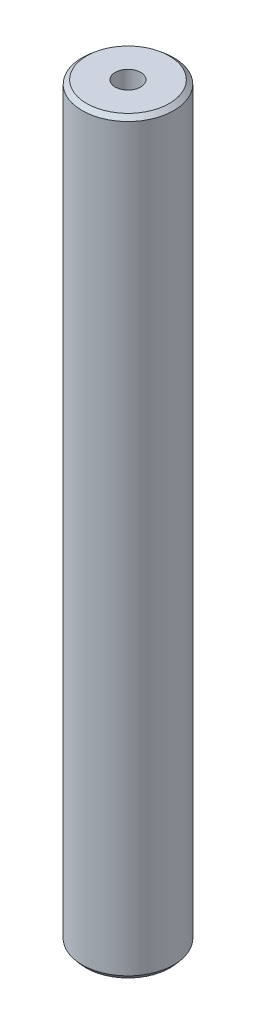
ISO-10303-21;
HEADER;
FILE_DESCRIPTION(('STEP AP214'),'2;1');
FILE_NAME('part.step','',(''),(''),'','','');
FILE_SCHEMA(('AUTOMOTIVE_DESIGN { 1 0 10303 214 1 1 1 1 }'));
ENDSEC;
DATA;
#1=APPLICATION_CONTEXT('core data for automotive mechanical design processes');
#2=APPLICATION_PROTOCOL_DEFINITION('international standard','automotive_design',2000,#1);
#3=PRODUCT_CONTEXT('',#1,'mechanical');
#4=PRODUCT('Part','Part','',(#3));
#5=PRODUCT_RELATED_PRODUCT_CATEGORY('part','',(#4));
#6=PRODUCT_DEFINITION_FORMATION('','',#4);
#7=PRODUCT_DEFINITION_CONTEXT('part definition',#1,'design');
#8=PRODUCT_DEFINITION('design','',#6,#7);
#9=PRODUCT_DEFINITION_SHAPE('','',#8);
#10=(LENGTH_UNIT() NAMED_UNIT(*) SI_UNIT(.MILLI.,.METRE.));
#11=(NAMED_UNIT(*) PLANE_ANGLE_UNIT() SI_UNIT($,.RADIAN.));
#12=(NAMED_UNIT(*) SI_UNIT($,.STERADIAN.) SOLID_ANGLE_UNIT());
#13=UNCERTAINTY_MEASURE_WITH_UNIT(LENGTH_MEASURE(1.E-05),#10,'distance_accuracy_value','');
#14=(GEOMETRIC_REPRESENTATION_CONTEXT(3) GLOBAL_UNCERTAINTY_ASSIGNED_CONTEXT((#13)) GLOBAL_UNIT_ASSIGNED_CONTEXT((#10,
#11,#12)) REPRESENTATION_CONTEXT('',''));
#15=CARTESIAN_POINT('',(0.,0.,0.));
#16=DIRECTION('',(0.,0.,1.));
#17=DIRECTION('',(1.,0.,0.));
#18=AXIS2_PLACEMENT_3D('',#15,#16,#17);
#19=CARTESIAN_POINT('',(0.,122.414115146037,0.));
#20=DIRECTION('',(0.,-1.,0.));
#21=DIRECTION('',(0.,0.,-1.));
#22=AXIS2_PLACEMENT_3D('',#19,#20,#21);
#23=CYLINDRICAL_SURFACE('',#22,7.5);
#24=CARTESIAN_POINT('',(0.,121.785864783848,0.));
#25=DIRECTION('',(0.,1.,0.));
#26=DIRECTION('',(0.,0.,1.));
#27=AXIS2_PLACEMENT_3D('',#24,#25,#26);
#28=CIRCLE('',#27,7.5);
#29=CARTESIAN_POINT('',(0.,121.785864783848,7.5));
#30=VERTEX_POINT('',#29);
#31=EDGE_CURVE('E50',#30,#30,#28,.F.);
#32=ORIENTED_EDGE('',*,*,#31,.T.);
#33=EDGE_LOOP('',(#32));
#34=FACE_BOUND('',#33,.T.);
#35=CARTESIAN_POINT('',(0.,0.748238375106486,0.));
#36=DIRECTION('',(0.,1.,0.));
#37=DIRECTION('',(0.,0.,1.));
#38=AXIS2_PLACEMENT_3D('',#35,#36,#37);
#39=CIRCLE('',#38,7.5);
#40=CARTESIAN_POINT('',(0.,0.748238375106486,7.5));
#41=VERTEX_POINT('',#40);
#42=EDGE_CURVE('E51',#41,#41,#39,.T.);
#43=ORIENTED_EDGE('',*,*,#42,.T.);
#44=EDGE_LOOP('',(#43));
#45=FACE_BOUND('',#44,.T.);
#46=ADVANCED_FACE('F39',(#34,#45),#23,.T.);
#47=CARTESIAN_POINT('',(0.,122.414115146037,0.));
#48=DIRECTION('',(0.,1.,0.));
#49=DIRECTION('',(0.,0.,1.));
#50=AXIS2_PLACEMENT_3D('',#47,#48,#49);
#51=PLANE('',#50);
#52=CARTESIAN_POINT('',(0.,122.414115146037,0.));
#53=DIRECTION('',(0.,1.,0.));
#54=DIRECTION('',(0.,0.,1.));
#55=AXIS2_PLACEMENT_3D('',#52,#53,#54);
#56=CIRCLE('',#55,6.75176162489352);
#57=CARTESIAN_POINT('',(0.,122.414115146037,6.75176162489352));
#58=VERTEX_POINT('',#57);
#59=EDGE_CURVE('E54',#58,#58,#56,.T.);
#60=ORIENTED_EDGE('',*,*,#59,.T.);
#61=EDGE_LOOP('',(#60));
#62=FACE_BOUND('',#61,.T.);
#63=CARTESIAN_POINT('',(0.,122.414115146037,0.));
#64=DIRECTION('',(0.,1.,0.));
#65=DIRECTION('',(0.,0.,1.));
#66=AXIS2_PLACEMENT_3D('',#63,#64,#65);
#67=CIRCLE('',#66,2.08619085192331);
#68=CARTESIAN_POINT('',(0.,122.414115146037,2.08619085192331));
#69=VERTEX_POINT('',#68);
#70=EDGE_CURVE('E58',#69,#69,#67,.T.);
#71=ORIENTED_EDGE('',*,*,#70,.F.);
#72=EDGE_LOOP('',(#71));
#73=FACE_BOUND('',#72,.T.);
#74=ADVANCED_FACE('F69',(#62,#73),#51,.T.);
#75=CARTESIAN_POINT('',(0.,0.,0.));
#76=DIRECTION('',(0.,1.,0.));
#77=DIRECTION('',(0.,0.,1.));
#78=AXIS2_PLACEMENT_3D('',#75,#76,#77);
#79=PLANE('',#78);
#80=CARTESIAN_POINT('',(0.,0.,0.));
#81=DIRECTION('',(0.,1.,0.));
#82=DIRECTION('',(0.,0.,1.));
#83=AXIS2_PLACEMENT_3D('',#80,#81,#82);
#84=CIRCLE('',#83,6.87174963781073);
#85=CARTESIAN_POINT('',(0.,0.,6.87174963781073));
#86=VERTEX_POINT('',#85);
#87=EDGE_CURVE('E10',#86,#86,#84,.F.);
#88=ORIENTED_EDGE('',*,*,#87,.T.);
#89=EDGE_LOOP('',(#88));
#90=FACE_BOUND('',#89,.T.);
#91=CARTESIAN_POINT('',(0.,0.,0.));
#92=DIRECTION('',(0.,1.,0.));
#93=DIRECTION('',(0.,0.,1.));
#94=AXIS2_PLACEMENT_3D('',#91,#92,#93);
#95=CIRCLE('',#94,2.08619085192331);
#96=CARTESIAN_POINT('',(0.,0.,2.08619085192331));
#97=VERTEX_POINT('',#96);
#98=EDGE_CURVE('E63',#97,#97,#95,.T.);
#99=ORIENTED_EDGE('',*,*,#98,.T.);
#100=EDGE_LOOP('',(#99));
#101=FACE_BOUND('',#100,.T.);
#102=ADVANCED_FACE('F75',(#90,#101),#79,.F.);
#103=CARTESIAN_POINT('',(0.,122.414115146037,0.));
#104=DIRECTION('',(0.,-1.,0.));
#105=DIRECTION('',(0.,0.,-1.));
#106=AXIS2_PLACEMENT_3D('',#103,#104,#105);
#107=CYLINDRICAL_SURFACE('',#106,2.08619085192331);
#108=ORIENTED_EDGE('',*,*,#70,.T.);
#109=EDGE_LOOP('',(#108));
#110=FACE_BOUND('',#109,.T.);
#111=ORIENTED_EDGE('',*,*,#98,.F.);
#112=EDGE_LOOP('',(#111));
#113=FACE_BOUND('',#112,.T.);
#114=ADVANCED_FACE('F70',(#110,#113),#107,.F.);
#115=CARTESIAN_POINT('',(0.,122.414115146037,0.));
#116=DIRECTION('',(0.,-1.,0.));
#117=DIRECTION('',(0.,0.,-1.));
#118=AXIS2_PLACEMENT_3D('',#115,#116,#117);
#119=CONICAL_SURFACE('',#118,6.75176162489352,0.87234800639992);
#120=ORIENTED_EDGE('',*,*,#31,.F.);
#121=EDGE_LOOP('',(#120));
#122=FACE_BOUND('',#121,.T.);
#123=ORIENTED_EDGE('',*,*,#59,.F.);
#124=EDGE_LOOP('',(#123));
#125=FACE_BOUND('',#124,.T.);
#126=ADVANCED_FACE('F81',(#122,#125),#119,.T.);
#127=CARTESIAN_POINT('',(0.,0.748238375106486,0.));
#128=DIRECTION('',(0.,1.,0.));
#129=DIRECTION('',(0.,0.,1.));
#130=AXIS2_PLACEMENT_3D('',#127,#128,#129);
#131=CONICAL_SURFACE('',#130,7.5,0.698448320394967);
#132=ORIENTED_EDGE('',*,*,#87,.F.);
#133=EDGE_LOOP('',(#132));
#134=FACE_BOUND('',#133,.T.);
#135=ORIENTED_EDGE('',*,*,#42,.F.);
#136=EDGE_LOOP('',(#135));
#137=FACE_BOUND('',#136,.T.);
#138=ADVANCED_FACE('F45',(#134,#137),#131,.T.);
#139=CLOSED_SHELL('',(#46,#74,#102,#114,#126,#138));
#140=MANIFOLD_SOLID_BREP('B2',#139);
#141=ADVANCED_BREP_SHAPE_REPRESENTATION('',(#18,#140),#14);
#142=SHAPE_DEFINITION_REPRESENTATION(#9,#141);
ENDSEC;
END-ISO-10303-21;
